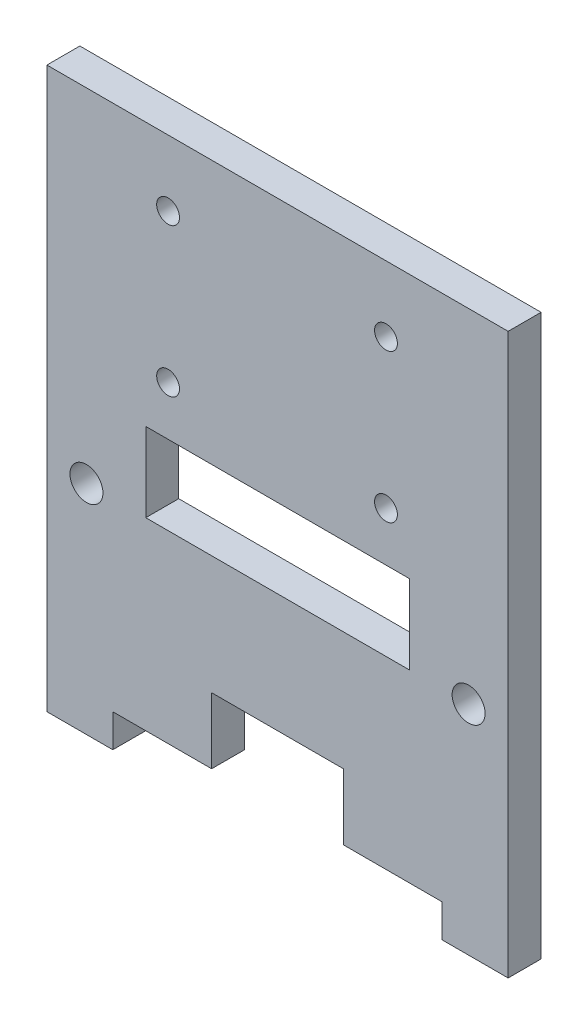
ISO-10303-21;
HEADER;
FILE_DESCRIPTION(('STEP AP214'),'2;1');
FILE_NAME('part.step','',(''),(''),'','','');
FILE_SCHEMA(('AUTOMOTIVE_DESIGN { 1 0 10303 214 1 1 1 1 }'));
ENDSEC;
DATA;
#1=APPLICATION_CONTEXT('core data for automotive mechanical design processes');
#2=APPLICATION_PROTOCOL_DEFINITION('international standard','automotive_design',2000,#1);
#3=PRODUCT_CONTEXT('',#1,'mechanical');
#4=PRODUCT('Part','Part','',(#3));
#5=PRODUCT_RELATED_PRODUCT_CATEGORY('part','',(#4));
#6=PRODUCT_DEFINITION_FORMATION('','',#4);
#7=PRODUCT_DEFINITION_CONTEXT('part definition',#1,'design');
#8=PRODUCT_DEFINITION('design','',#6,#7);
#9=PRODUCT_DEFINITION_SHAPE('','',#8);
#10=(LENGTH_UNIT() NAMED_UNIT(*) SI_UNIT(.MILLI.,.METRE.));
#11=(NAMED_UNIT(*) PLANE_ANGLE_UNIT() SI_UNIT($,.RADIAN.));
#12=(NAMED_UNIT(*) SI_UNIT($,.STERADIAN.) SOLID_ANGLE_UNIT());
#13=UNCERTAINTY_MEASURE_WITH_UNIT(LENGTH_MEASURE(1.E-05),#10,'distance_accuracy_value','');
#14=(GEOMETRIC_REPRESENTATION_CONTEXT(3) GLOBAL_UNCERTAINTY_ASSIGNED_CONTEXT((#13)) GLOBAL_UNIT_ASSIGNED_CONTEXT((#10,
#11,#12)) REPRESENTATION_CONTEXT('',''));
#15=CARTESIAN_POINT('',(0.,0.,0.));
#16=DIRECTION('',(0.,0.,1.));
#17=DIRECTION('',(1.,0.,0.));
#18=AXIS2_PLACEMENT_3D('',#15,#16,#17);
#19=CARTESIAN_POINT('',(6.35,3.175,0.));
#20=DIRECTION('',(0.,1.,0.));
#21=DIRECTION('',(0.,0.,1.));
#22=AXIS2_PLACEMENT_3D('',#19,#20,#21);
#23=PLANE('',#22);
#24=DIRECTION('',(-1.,0.,0.));
#25=VECTOR('',#24,1.);
#26=CARTESIAN_POINT('',(6.35,3.175,0.));
#27=LINE('',#26,#25);
#28=CARTESIAN_POINT('',(15.875,3.175,0.));
#29=VERTEX_POINT('',#28);
#30=CARTESIAN_POINT('',(6.35,3.175,0.));
#31=VERTEX_POINT('',#30);
#32=EDGE_CURVE('E275',#29,#31,#27,.T.);
#33=ORIENTED_EDGE('',*,*,#32,.F.);
#34=DIRECTION('',(0.,0.,1.));
#35=VECTOR('',#34,1.);
#36=CARTESIAN_POINT('',(15.875,3.175,0.));
#37=LINE('',#36,#35);
#38=CARTESIAN_POINT('',(15.875,3.175,3.175));
#39=VERTEX_POINT('',#38);
#40=EDGE_CURVE('E227',#29,#39,#37,.T.);
#41=ORIENTED_EDGE('',*,*,#40,.T.);
#42=DIRECTION('',(-1.,0.,0.));
#43=VECTOR('',#42,1.);
#44=CARTESIAN_POINT('',(6.35,3.175,3.175));
#45=LINE('',#44,#43);
#46=CARTESIAN_POINT('',(6.35,3.175,3.175));
#47=VERTEX_POINT('',#46);
#48=EDGE_CURVE('E289',#39,#47,#45,.T.);
#49=ORIENTED_EDGE('',*,*,#48,.T.);
#50=DIRECTION('',(0.,0.,1.));
#51=VECTOR('',#50,1.);
#52=CARTESIAN_POINT('',(6.35,3.175,0.));
#53=LINE('',#52,#51);
#54=EDGE_CURVE('E293',#31,#47,#53,.T.);
#55=ORIENTED_EDGE('',*,*,#54,.F.);
#56=EDGE_LOOP('',(#33,#41,#49,#55));
#57=FACE_BOUND('',#56,.T.);
#58=ADVANCED_FACE('F39',(#57),#23,.F.);
#59=CARTESIAN_POINT('',(0.,0.,3.175));
#60=DIRECTION('',(0.,1.,0.));
#61=DIRECTION('',(-1.,0.,0.));
#62=AXIS2_PLACEMENT_3D('',#59,#60,#61);
#63=PLANE('',#62);
#64=DIRECTION('',(1.,0.,0.));
#65=VECTOR('',#64,1.);
#66=CARTESIAN_POINT('',(0.,0.,0.));
#67=LINE('',#66,#65);
#68=CARTESIAN_POINT('',(0.,0.,0.));
#69=VERTEX_POINT('',#68);
#70=CARTESIAN_POINT('',(6.35,0.,0.));
#71=VERTEX_POINT('',#70);
#72=EDGE_CURVE('E328',#69,#71,#67,.T.);
#73=ORIENTED_EDGE('',*,*,#72,.T.);
#74=DIRECTION('',(0.,0.,1.));
#75=VECTOR('',#74,1.);
#76=CARTESIAN_POINT('',(6.35,0.,0.));
#77=LINE('',#76,#75);
#78=CARTESIAN_POINT('',(6.35,0.,3.175));
#79=VERTEX_POINT('',#78);
#80=EDGE_CURVE('E280',#71,#79,#77,.T.);
#81=ORIENTED_EDGE('',*,*,#80,.T.);
#82=DIRECTION('',(1.,0.,0.));
#83=VECTOR('',#82,1.);
#84=CARTESIAN_POINT('',(0.,0.,3.175));
#85=LINE('',#84,#83);
#86=CARTESIAN_POINT('',(0.,0.,3.175));
#87=VERTEX_POINT('',#86);
#88=EDGE_CURVE('E313',#87,#79,#85,.T.);
#89=ORIENTED_EDGE('',*,*,#88,.F.);
#90=DIRECTION('',(0.,0.,-1.));
#91=VECTOR('',#90,1.);
#92=CARTESIAN_POINT('',(0.,0.,3.175));
#93=LINE('',#92,#91);
#94=EDGE_CURVE('E11',#87,#69,#93,.T.);
#95=ORIENTED_EDGE('',*,*,#94,.T.);
#96=EDGE_LOOP('',(#73,#81,#89,#95));
#97=FACE_BOUND('',#96,.T.);
#98=ADVANCED_FACE('F430',(#97),#63,.F.);
#99=CARTESIAN_POINT('',(0.,0.,3.175));
#100=DIRECTION('',(1.,0.,0.));
#101=DIRECTION('',(0.,0.,-1.));
#102=AXIS2_PLACEMENT_3D('',#99,#100,#101);
#103=PLANE('',#102);
#104=DIRECTION('',(0.,-1.,0.));
#105=VECTOR('',#104,1.);
#106=CARTESIAN_POINT('',(0.,0.,0.));
#107=LINE('',#106,#105);
#108=CARTESIAN_POINT('',(0.,53.975,0.));
#109=VERTEX_POINT('',#108);
#110=EDGE_CURVE('E297',#109,#69,#107,.T.);
#111=ORIENTED_EDGE('',*,*,#110,.T.);
#112=ORIENTED_EDGE('',*,*,#94,.F.);
#113=DIRECTION('',(0.,-1.,0.));
#114=VECTOR('',#113,1.);
#115=CARTESIAN_POINT('',(0.,0.,3.175));
#116=LINE('',#115,#114);
#117=CARTESIAN_POINT('',(0.,53.975,3.175));
#118=VERTEX_POINT('',#117);
#119=EDGE_CURVE('E307',#118,#87,#116,.T.);
#120=ORIENTED_EDGE('',*,*,#119,.F.);
#121=DIRECTION('',(0.,0.,-1.));
#122=VECTOR('',#121,1.);
#123=CARTESIAN_POINT('',(0.,53.975,3.175));
#124=LINE('',#123,#122);
#125=EDGE_CURVE('E323',#118,#109,#124,.T.);
#126=ORIENTED_EDGE('',*,*,#125,.T.);
#127=EDGE_LOOP('',(#111,#112,#120,#126));
#128=FACE_BOUND('',#127,.T.);
#129=ADVANCED_FACE('F41',(#128),#103,.F.);
#130=CARTESIAN_POINT('',(38.1,0.,3.175));
#131=VERTEX_POINT('',#130);
#132=CARTESIAN_POINT('',(44.45,0.,3.175));
#133=VERTEX_POINT('',#132);
#134=EDGE_CURVE('E311',#131,#133,#85,.T.);
#135=ORIENTED_EDGE('',*,*,#134,.F.);
#136=DIRECTION('',(0.,0.,1.));
#137=VECTOR('',#136,1.);
#138=CARTESIAN_POINT('',(38.1,0.,0.));
#139=LINE('',#138,#137);
#140=CARTESIAN_POINT('',(38.1,0.,0.));
#141=VERTEX_POINT('',#140);
#142=EDGE_CURVE('E301',#141,#131,#139,.T.);
#143=ORIENTED_EDGE('',*,*,#142,.F.);
#144=CARTESIAN_POINT('',(44.45,0.,0.));
#145=VERTEX_POINT('',#144);
#146=EDGE_CURVE('E327',#141,#145,#67,.T.);
#147=ORIENTED_EDGE('',*,*,#146,.T.);
#148=DIRECTION('',(0.,0.,-1.));
#149=VECTOR('',#148,1.);
#150=CARTESIAN_POINT('',(44.45,0.,3.175));
#151=LINE('',#150,#149);
#152=EDGE_CURVE('E48',#133,#145,#151,.T.);
#153=ORIENTED_EDGE('',*,*,#152,.F.);
#154=EDGE_LOOP('',(#135,#143,#147,#153));
#155=FACE_BOUND('',#154,.T.);
#156=ADVANCED_FACE('F438',(#155),#63,.F.);
#157=CARTESIAN_POINT('',(44.45,0.,3.175));
#158=DIRECTION('',(-1.,0.,0.));
#159=DIRECTION('',(0.,0.,1.));
#160=AXIS2_PLACEMENT_3D('',#157,#158,#159);
#161=PLANE('',#160);
#162=DIRECTION('',(0.,1.,0.));
#163=VECTOR('',#162,1.);
#164=CARTESIAN_POINT('',(44.45,0.,0.));
#165=LINE('',#164,#163);
#166=CARTESIAN_POINT('',(44.45,53.975,0.));
#167=VERTEX_POINT('',#166);
#168=EDGE_CURVE('E332',#145,#167,#165,.T.);
#169=ORIENTED_EDGE('',*,*,#168,.T.);
#170=DIRECTION('',(0.,0.,-1.));
#171=VECTOR('',#170,1.);
#172=CARTESIAN_POINT('',(44.45,53.975,3.175));
#173=LINE('',#172,#171);
#174=CARTESIAN_POINT('',(44.45,53.975,3.175));
#175=VERTEX_POINT('',#174);
#176=EDGE_CURVE('E340',#175,#167,#173,.T.);
#177=ORIENTED_EDGE('',*,*,#176,.F.);
#178=DIRECTION('',(0.,1.,0.));
#179=VECTOR('',#178,1.);
#180=CARTESIAN_POINT('',(44.45,0.,3.175));
#181=LINE('',#180,#179);
#182=EDGE_CURVE('E317',#133,#175,#181,.T.);
#183=ORIENTED_EDGE('',*,*,#182,.F.);
#184=ORIENTED_EDGE('',*,*,#152,.T.);
#185=EDGE_LOOP('',(#169,#177,#183,#184));
#186=FACE_BOUND('',#185,.T.);
#187=ADVANCED_FACE('F349',(#186),#161,.F.);
#188=CARTESIAN_POINT('',(0.,53.975,3.175));
#189=DIRECTION('',(0.,-1.,0.));
#190=DIRECTION('',(0.,0.,-1.));
#191=AXIS2_PLACEMENT_3D('',#188,#189,#190);
#192=PLANE('',#191);
#193=DIRECTION('',(-1.,0.,0.));
#194=VECTOR('',#193,1.);
#195=CARTESIAN_POINT('',(0.,53.975,0.));
#196=LINE('',#195,#194);
#197=EDGE_CURVE('E312',#167,#109,#196,.T.);
#198=ORIENTED_EDGE('',*,*,#197,.T.);
#199=ORIENTED_EDGE('',*,*,#125,.F.);
#200=DIRECTION('',(-1.,0.,0.));
#201=VECTOR('',#200,1.);
#202=CARTESIAN_POINT('',(0.,53.975,3.175));
#203=LINE('',#202,#201);
#204=EDGE_CURVE('E320',#175,#118,#203,.T.);
#205=ORIENTED_EDGE('',*,*,#204,.F.);
#206=ORIENTED_EDGE('',*,*,#176,.T.);
#207=EDGE_LOOP('',(#198,#199,#205,#206));
#208=FACE_BOUND('',#207,.T.);
#209=ADVANCED_FACE('F360',(#208),#192,.F.);
#210=CARTESIAN_POINT('',(0.,0.,3.175));
#211=DIRECTION('',(0.,0.,-1.));
#212=DIRECTION('',(-1.,0.,0.));
#213=AXIS2_PLACEMENT_3D('',#210,#211,#212);
#214=PLANE('',#213);
#215=CARTESIAN_POINT('',(3.81,20.955,3.175));
#216=DIRECTION('',(0.,0.,1.));
#217=DIRECTION('',(1.,0.,0.));
#218=AXIS2_PLACEMENT_3D('',#215,#216,#217);
#219=CIRCLE('',#218,1.5875);
#220=CARTESIAN_POINT('',(5.3975,20.955,3.175));
#221=VERTEX_POINT('',#220);
#222=EDGE_CURVE('E208',#221,#221,#219,.T.);
#223=ORIENTED_EDGE('',*,*,#222,.F.);
#224=EDGE_LOOP('',(#223));
#225=FACE_BOUND('',#224,.T.);
#226=DIRECTION('',(1.,0.,0.));
#227=VECTOR('',#226,1.);
#228=CARTESIAN_POINT('',(9.52500000000001,20.955,3.175));
#229=LINE('',#228,#227);
#230=CARTESIAN_POINT('',(9.52500000000001,20.955,3.175));
#231=VERTEX_POINT('',#230);
#232=CARTESIAN_POINT('',(34.925,20.955,3.175));
#233=VERTEX_POINT('',#232);
#234=EDGE_CURVE('E190',#231,#233,#229,.T.);
#235=ORIENTED_EDGE('',*,*,#234,.F.);
#236=DIRECTION('',(0.,-1.,0.));
#237=VECTOR('',#236,1.);
#238=CARTESIAN_POINT('',(9.525,28.575,3.175));
#239=LINE('',#238,#237);
#240=CARTESIAN_POINT('',(9.525,28.575,3.175));
#241=VERTEX_POINT('',#240);
#242=EDGE_CURVE('E55',#241,#231,#239,.T.);
#243=ORIENTED_EDGE('',*,*,#242,.F.);
#244=DIRECTION('',(-1.,0.,0.));
#245=VECTOR('',#244,1.);
#246=CARTESIAN_POINT('',(9.525,28.575,3.175));
#247=LINE('',#246,#245);
#248=CARTESIAN_POINT('',(34.925,28.575,3.175));
#249=VERTEX_POINT('',#248);
#250=EDGE_CURVE('E174',#249,#241,#247,.T.);
#251=ORIENTED_EDGE('',*,*,#250,.F.);
#252=DIRECTION('',(0.,1.,0.));
#253=VECTOR('',#252,1.);
#254=CARTESIAN_POINT('',(34.925,28.575,3.175));
#255=LINE('',#254,#253);
#256=EDGE_CURVE('E178',#233,#249,#255,.T.);
#257=ORIENTED_EDGE('',*,*,#256,.F.);
#258=EDGE_LOOP('',(#235,#243,#251,#257));
#259=FACE_BOUND('',#258,.T.);
#260=CARTESIAN_POINT('',(32.6772125959636,33.325,3.175));
#261=DIRECTION('',(0.,0.,1.));
#262=DIRECTION('',(1.,0.,0.));
#263=AXIS2_PLACEMENT_3D('',#260,#261,#262);
#264=CIRCLE('',#263,1.1);
#265=CARTESIAN_POINT('',(33.7772125959636,33.325,3.175));
#266=VERTEX_POINT('',#265);
#267=EDGE_CURVE('E181',#266,#266,#264,.T.);
#268=ORIENTED_EDGE('',*,*,#267,.F.);
#269=EDGE_LOOP('',(#268));
#270=FACE_BOUND('',#269,.T.);
#271=CARTESIAN_POINT('',(32.6772125959636,47.625,3.175));
#272=DIRECTION('',(0.,0.,1.));
#273=DIRECTION('',(1.,0.,0.));
#274=AXIS2_PLACEMENT_3D('',#271,#272,#273);
#275=CIRCLE('',#274,1.1);
#276=CARTESIAN_POINT('',(33.7772125959636,47.625,3.175));
#277=VERTEX_POINT('',#276);
#278=EDGE_CURVE('E385',#277,#277,#275,.T.);
#279=ORIENTED_EDGE('',*,*,#278,.F.);
#280=EDGE_LOOP('',(#279));
#281=FACE_BOUND('',#280,.T.);
#282=CARTESIAN_POINT('',(11.6772125959636,33.325,3.175));
#283=DIRECTION('',(0.,0.,1.));
#284=DIRECTION('',(1.,0.,0.));
#285=AXIS2_PLACEMENT_3D('',#282,#283,#284);
#286=CIRCLE('',#285,1.1);
#287=CARTESIAN_POINT('',(12.7772125959636,33.325,3.175));
#288=VERTEX_POINT('',#287);
#289=EDGE_CURVE('E261',#288,#288,#286,.T.);
#290=ORIENTED_EDGE('',*,*,#289,.F.);
#291=EDGE_LOOP('',(#290));
#292=FACE_BOUND('',#291,.T.);
#293=CARTESIAN_POINT('',(11.6772125959636,47.625,3.175));
#294=DIRECTION('',(0.,0.,1.));
#295=DIRECTION('',(1.,0.,0.));
#296=AXIS2_PLACEMENT_3D('',#293,#294,#295);
#297=CIRCLE('',#296,1.1);
#298=CARTESIAN_POINT('',(12.7772125959636,47.625,3.175));
#299=VERTEX_POINT('',#298);
#300=EDGE_CURVE('E253',#299,#299,#297,.T.);
#301=ORIENTED_EDGE('',*,*,#300,.F.);
#302=EDGE_LOOP('',(#301));
#303=FACE_BOUND('',#302,.T.);
#304=CARTESIAN_POINT('',(40.64,20.955,3.175));
#305=DIRECTION('',(0.,0.,1.));
#306=DIRECTION('',(-1.,0.,0.));
#307=AXIS2_PLACEMENT_3D('',#304,#305,#306);
#308=CIRCLE('',#307,1.58750000000001);
#309=CARTESIAN_POINT('',(39.0525,20.955,3.175));
#310=VERTEX_POINT('',#309);
#311=EDGE_CURVE('E209',#310,#310,#308,.T.);
#312=ORIENTED_EDGE('',*,*,#311,.F.);
#313=EDGE_LOOP('',(#312));
#314=FACE_BOUND('',#313,.T.);
#315=ORIENTED_EDGE('',*,*,#48,.F.);
#316=DIRECTION('',(0.,-1.,0.));
#317=VECTOR('',#316,1.);
#318=CARTESIAN_POINT('',(15.875,3.175,3.175));
#319=LINE('',#318,#317);
#320=CARTESIAN_POINT('',(15.875,9.525,3.175));
#321=VERTEX_POINT('',#320);
#322=EDGE_CURVE('E228',#321,#39,#319,.T.);
#323=ORIENTED_EDGE('',*,*,#322,.F.);
#324=DIRECTION('',(-1.,0.,0.));
#325=VECTOR('',#324,1.);
#326=CARTESIAN_POINT('',(15.875,9.525,3.175));
#327=LINE('',#326,#325);
#328=CARTESIAN_POINT('',(28.575,9.525,3.175));
#329=VERTEX_POINT('',#328);
#330=EDGE_CURVE('E219',#329,#321,#327,.T.);
#331=ORIENTED_EDGE('',*,*,#330,.F.);
#332=DIRECTION('',(0.,1.,0.));
#333=VECTOR('',#332,1.);
#334=CARTESIAN_POINT('',(28.575,3.175,3.175));
#335=LINE('',#334,#333);
#336=CARTESIAN_POINT('',(28.575,3.175,3.175));
#337=VERTEX_POINT('',#336);
#338=EDGE_CURVE('E231',#337,#329,#335,.T.);
#339=ORIENTED_EDGE('',*,*,#338,.F.);
#340=CARTESIAN_POINT('',(38.1,3.175,3.175));
#341=VERTEX_POINT('',#340);
#342=EDGE_CURVE('E271',#341,#337,#45,.T.);
#343=ORIENTED_EDGE('',*,*,#342,.F.);
#344=DIRECTION('',(0.,1.,0.));
#345=VECTOR('',#344,1.);
#346=CARTESIAN_POINT('',(38.1,0.,3.175));
#347=LINE('',#346,#345);
#348=EDGE_CURVE('E284',#131,#341,#347,.T.);
#349=ORIENTED_EDGE('',*,*,#348,.F.);
#350=ORIENTED_EDGE('',*,*,#134,.T.);
#351=ORIENTED_EDGE('',*,*,#182,.T.);
#352=ORIENTED_EDGE('',*,*,#204,.T.);
#353=ORIENTED_EDGE('',*,*,#119,.T.);
#354=ORIENTED_EDGE('',*,*,#88,.T.);
#355=DIRECTION('',(0.,-1.,0.));
#356=VECTOR('',#355,1.);
#357=CARTESIAN_POINT('',(6.35,0.,3.175));
#358=LINE('',#357,#356);
#359=EDGE_CURVE('E281',#47,#79,#358,.T.);
#360=ORIENTED_EDGE('',*,*,#359,.F.);
#361=EDGE_LOOP('',(#315,#323,#331,#339,#343,#349,#350,#351,#352,#353,#354,#360));
#362=FACE_BOUND('',#361,.T.);
#363=ADVANCED_FACE('F367',(#225,#259,#270,#281,#292,#303,#314,#362),#214,.F.);
#364=CARTESIAN_POINT('',(0.,0.,0.));
#365=DIRECTION('',(0.,0.,-1.));
#366=DIRECTION('',(-1.,0.,0.));
#367=AXIS2_PLACEMENT_3D('',#364,#365,#366);
#368=PLANE('',#367);
#369=CARTESIAN_POINT('',(3.81,20.955,0.));
#370=DIRECTION('',(0.,0.,1.));
#371=DIRECTION('',(1.,0.,0.));
#372=AXIS2_PLACEMENT_3D('',#369,#370,#371);
#373=CIRCLE('',#372,1.5875);
#374=CARTESIAN_POINT('',(5.3975,20.955,0.));
#375=VERTEX_POINT('',#374);
#376=EDGE_CURVE('E285',#375,#375,#373,.T.);
#377=ORIENTED_EDGE('',*,*,#376,.T.);
#378=EDGE_LOOP('',(#377));
#379=FACE_BOUND('',#378,.T.);
#380=DIRECTION('',(0.,-1.,0.));
#381=VECTOR('',#380,1.);
#382=CARTESIAN_POINT('',(9.525,28.575,0.));
#383=LINE('',#382,#381);
#384=CARTESIAN_POINT('',(9.525,28.575,0.));
#385=VERTEX_POINT('',#384);
#386=CARTESIAN_POINT('',(9.52500000000001,20.955,0.));
#387=VERTEX_POINT('',#386);
#388=EDGE_CURVE('E155',#385,#387,#383,.T.);
#389=ORIENTED_EDGE('',*,*,#388,.T.);
#390=DIRECTION('',(1.,0.,0.));
#391=VECTOR('',#390,1.);
#392=CARTESIAN_POINT('',(9.52500000000001,20.955,0.));
#393=LINE('',#392,#391);
#394=CARTESIAN_POINT('',(34.925,20.955,0.));
#395=VERTEX_POINT('',#394);
#396=EDGE_CURVE('E165',#387,#395,#393,.T.);
#397=ORIENTED_EDGE('',*,*,#396,.T.);
#398=DIRECTION('',(0.,1.,0.));
#399=VECTOR('',#398,1.);
#400=CARTESIAN_POINT('',(34.925,28.575,0.));
#401=LINE('',#400,#399);
#402=CARTESIAN_POINT('',(34.925,28.575,0.));
#403=VERTEX_POINT('',#402);
#404=EDGE_CURVE('E63',#395,#403,#401,.T.);
#405=ORIENTED_EDGE('',*,*,#404,.T.);
#406=DIRECTION('',(-1.,0.,0.));
#407=VECTOR('',#406,1.);
#408=CARTESIAN_POINT('',(9.525,28.575,0.));
#409=LINE('',#408,#407);
#410=EDGE_CURVE('E162',#403,#385,#409,.T.);
#411=ORIENTED_EDGE('',*,*,#410,.T.);
#412=EDGE_LOOP('',(#389,#397,#405,#411));
#413=FACE_BOUND('',#412,.T.);
#414=CARTESIAN_POINT('',(32.6772125959636,33.325,0.));
#415=DIRECTION('',(0.,0.,1.));
#416=DIRECTION('',(1.,0.,0.));
#417=AXIS2_PLACEMENT_3D('',#414,#415,#416);
#418=CIRCLE('',#417,1.1);
#419=CARTESIAN_POINT('',(33.7772125959636,33.325,0.));
#420=VERTEX_POINT('',#419);
#421=EDGE_CURVE('E389',#420,#420,#418,.T.);
#422=ORIENTED_EDGE('',*,*,#421,.T.);
#423=EDGE_LOOP('',(#422));
#424=FACE_BOUND('',#423,.T.);
#425=CARTESIAN_POINT('',(32.6772125959636,47.625,0.));
#426=DIRECTION('',(0.,0.,1.));
#427=DIRECTION('',(1.,0.,0.));
#428=AXIS2_PLACEMENT_3D('',#425,#426,#427);
#429=CIRCLE('',#428,1.1);
#430=CARTESIAN_POINT('',(33.7772125959636,47.625,0.));
#431=VERTEX_POINT('',#430);
#432=EDGE_CURVE('E265',#431,#431,#429,.T.);
#433=ORIENTED_EDGE('',*,*,#432,.T.);
#434=EDGE_LOOP('',(#433));
#435=FACE_BOUND('',#434,.T.);
#436=CARTESIAN_POINT('',(11.6772125959636,33.325,0.));
#437=DIRECTION('',(0.,0.,1.));
#438=DIRECTION('',(1.,0.,0.));
#439=AXIS2_PLACEMENT_3D('',#436,#437,#438);
#440=CIRCLE('',#439,1.1);
#441=CARTESIAN_POINT('',(12.7772125959636,33.325,0.));
#442=VERTEX_POINT('',#441);
#443=EDGE_CURVE('E257',#442,#442,#440,.T.);
#444=ORIENTED_EDGE('',*,*,#443,.T.);
#445=EDGE_LOOP('',(#444));
#446=FACE_BOUND('',#445,.T.);
#447=CARTESIAN_POINT('',(11.6772125959636,47.625,0.));
#448=DIRECTION('',(0.,0.,1.));
#449=DIRECTION('',(1.,0.,0.));
#450=AXIS2_PLACEMENT_3D('',#447,#448,#449);
#451=CIRCLE('',#450,1.1);
#452=CARTESIAN_POINT('',(12.7772125959636,47.625,0.));
#453=VERTEX_POINT('',#452);
#454=EDGE_CURVE('E232',#453,#453,#451,.T.);
#455=ORIENTED_EDGE('',*,*,#454,.T.);
#456=EDGE_LOOP('',(#455));
#457=FACE_BOUND('',#456,.T.);
#458=DIRECTION('',(0.,-1.,0.));
#459=VECTOR('',#458,1.);
#460=CARTESIAN_POINT('',(15.875,3.175,0.));
#461=LINE('',#460,#459);
#462=CARTESIAN_POINT('',(15.875,9.525,0.));
#463=VERTEX_POINT('',#462);
#464=EDGE_CURVE('E214',#463,#29,#461,.T.);
#465=ORIENTED_EDGE('',*,*,#464,.T.);
#466=ORIENTED_EDGE('',*,*,#32,.T.);
#467=DIRECTION('',(0.,-1.,0.));
#468=VECTOR('',#467,1.);
#469=CARTESIAN_POINT('',(6.35,0.,0.));
#470=LINE('',#469,#468);
#471=EDGE_CURVE('E266',#31,#71,#470,.T.);
#472=ORIENTED_EDGE('',*,*,#471,.T.);
#473=ORIENTED_EDGE('',*,*,#72,.F.);
#474=ORIENTED_EDGE('',*,*,#110,.F.);
#475=ORIENTED_EDGE('',*,*,#197,.F.);
#476=ORIENTED_EDGE('',*,*,#168,.F.);
#477=ORIENTED_EDGE('',*,*,#146,.F.);
#478=DIRECTION('',(0.,1.,0.));
#479=VECTOR('',#478,1.);
#480=CARTESIAN_POINT('',(38.1,0.,0.));
#481=LINE('',#480,#479);
#482=CARTESIAN_POINT('',(38.1,3.175,0.));
#483=VERTEX_POINT('',#482);
#484=EDGE_CURVE('E270',#141,#483,#481,.T.);
#485=ORIENTED_EDGE('',*,*,#484,.T.);
#486=CARTESIAN_POINT('',(28.575,3.175,0.));
#487=VERTEX_POINT('',#486);
#488=EDGE_CURVE('E276',#483,#487,#27,.T.);
#489=ORIENTED_EDGE('',*,*,#488,.T.);
#490=DIRECTION('',(0.,1.,0.));
#491=VECTOR('',#490,1.);
#492=CARTESIAN_POINT('',(28.575,3.175,0.));
#493=LINE('',#492,#491);
#494=CARTESIAN_POINT('',(28.575,9.525,0.));
#495=VERTEX_POINT('',#494);
#496=EDGE_CURVE('E218',#487,#495,#493,.T.);
#497=ORIENTED_EDGE('',*,*,#496,.T.);
#498=DIRECTION('',(-1.,0.,0.));
#499=VECTOR('',#498,1.);
#500=CARTESIAN_POINT('',(15.875,9.525,0.));
#501=LINE('',#500,#499);
#502=EDGE_CURVE('E223',#495,#463,#501,.T.);
#503=ORIENTED_EDGE('',*,*,#502,.T.);
#504=EDGE_LOOP('',(#465,#466,#472,#473,#474,#475,#476,#477,#485,#489,#497,#503));
#505=FACE_BOUND('',#504,.T.);
#506=CARTESIAN_POINT('',(40.64,20.955,0.));
#507=DIRECTION('',(0.,0.,1.));
#508=DIRECTION('',(-1.,0.,0.));
#509=AXIS2_PLACEMENT_3D('',#506,#507,#508);
#510=CIRCLE('',#509,1.58750000000001);
#511=CARTESIAN_POINT('',(39.0525,20.955,0.));
#512=VERTEX_POINT('',#511);
#513=EDGE_CURVE('E204',#512,#512,#510,.T.);
#514=ORIENTED_EDGE('',*,*,#513,.T.);
#515=EDGE_LOOP('',(#514));
#516=FACE_BOUND('',#515,.T.);
#517=ADVANCED_FACE('F170',(#379,#413,#424,#435,#446,#457,#505,#516),#368,.T.);
#518=CARTESIAN_POINT('',(6.35,0.,0.));
#519=DIRECTION('',(-1.,0.,0.));
#520=DIRECTION('',(0.,0.,1.));
#521=AXIS2_PLACEMENT_3D('',#518,#519,#520);
#522=PLANE('',#521);
#523=ORIENTED_EDGE('',*,*,#359,.T.);
#524=ORIENTED_EDGE('',*,*,#80,.F.);
#525=ORIENTED_EDGE('',*,*,#471,.F.);
#526=ORIENTED_EDGE('',*,*,#54,.T.);
#527=EDGE_LOOP('',(#523,#524,#525,#526));
#528=FACE_BOUND('',#527,.T.);
#529=ADVANCED_FACE('F444',(#528),#522,.F.);
#530=ORIENTED_EDGE('',*,*,#342,.T.);
#531=DIRECTION('',(0.,0.,1.));
#532=VECTOR('',#531,1.);
#533=CARTESIAN_POINT('',(28.575,3.175,0.));
#534=LINE('',#533,#532);
#535=EDGE_CURVE('E244',#487,#337,#534,.T.);
#536=ORIENTED_EDGE('',*,*,#535,.F.);
#537=ORIENTED_EDGE('',*,*,#488,.F.);
#538=DIRECTION('',(0.,0.,1.));
#539=VECTOR('',#538,1.);
#540=CARTESIAN_POINT('',(38.1,3.175,0.));
#541=LINE('',#540,#539);
#542=EDGE_CURVE('E298',#483,#341,#541,.T.);
#543=ORIENTED_EDGE('',*,*,#542,.T.);
#544=EDGE_LOOP('',(#530,#536,#537,#543));
#545=FACE_BOUND('',#544,.T.);
#546=ADVANCED_FACE('F433',(#545),#23,.F.);
#547=CARTESIAN_POINT('',(38.1,0.,0.));
#548=DIRECTION('',(1.,0.,0.));
#549=DIRECTION('',(0.,0.,-1.));
#550=AXIS2_PLACEMENT_3D('',#547,#548,#549);
#551=PLANE('',#550);
#552=ORIENTED_EDGE('',*,*,#348,.T.);
#553=ORIENTED_EDGE('',*,*,#542,.F.);
#554=ORIENTED_EDGE('',*,*,#484,.F.);
#555=ORIENTED_EDGE('',*,*,#142,.T.);
#556=EDGE_LOOP('',(#552,#553,#554,#555));
#557=FACE_BOUND('',#556,.T.);
#558=ADVANCED_FACE('F443',(#557),#551,.F.);
#559=CARTESIAN_POINT('',(15.875,3.175,0.));
#560=DIRECTION('',(-1.,0.,0.));
#561=DIRECTION('',(0.,0.,1.));
#562=AXIS2_PLACEMENT_3D('',#559,#560,#561);
#563=PLANE('',#562);
#564=ORIENTED_EDGE('',*,*,#322,.T.);
#565=ORIENTED_EDGE('',*,*,#40,.F.);
#566=ORIENTED_EDGE('',*,*,#464,.F.);
#567=DIRECTION('',(0.,0.,1.));
#568=VECTOR('',#567,1.);
#569=CARTESIAN_POINT('',(15.875,9.525,0.));
#570=LINE('',#569,#568);
#571=EDGE_CURVE('E213',#463,#321,#570,.T.);
#572=ORIENTED_EDGE('',*,*,#571,.T.);
#573=EDGE_LOOP('',(#564,#565,#566,#572));
#574=FACE_BOUND('',#573,.T.);
#575=ADVANCED_FACE('F450',(#574),#563,.F.);
#576=CARTESIAN_POINT('',(15.875,9.525,0.));
#577=DIRECTION('',(0.,1.,0.));
#578=DIRECTION('',(0.,0.,1.));
#579=AXIS2_PLACEMENT_3D('',#576,#577,#578);
#580=PLANE('',#579);
#581=ORIENTED_EDGE('',*,*,#330,.T.);
#582=ORIENTED_EDGE('',*,*,#571,.F.);
#583=ORIENTED_EDGE('',*,*,#502,.F.);
#584=DIRECTION('',(0.,0.,1.));
#585=VECTOR('',#584,1.);
#586=CARTESIAN_POINT('',(28.575,9.525,0.));
#587=LINE('',#586,#585);
#588=EDGE_CURVE('E241',#495,#329,#587,.T.);
#589=ORIENTED_EDGE('',*,*,#588,.T.);
#590=EDGE_LOOP('',(#581,#582,#583,#589));
#591=FACE_BOUND('',#590,.T.);
#592=ADVANCED_FACE('F423',(#591),#580,.F.);
#593=CARTESIAN_POINT('',(28.575,3.175,0.));
#594=DIRECTION('',(1.,0.,0.));
#595=DIRECTION('',(0.,0.,-1.));
#596=AXIS2_PLACEMENT_3D('',#593,#594,#595);
#597=PLANE('',#596);
#598=ORIENTED_EDGE('',*,*,#338,.T.);
#599=ORIENTED_EDGE('',*,*,#588,.F.);
#600=ORIENTED_EDGE('',*,*,#496,.F.);
#601=ORIENTED_EDGE('',*,*,#535,.T.);
#602=EDGE_LOOP('',(#598,#599,#600,#601));
#603=FACE_BOUND('',#602,.T.);
#604=ADVANCED_FACE('F413',(#603),#597,.F.);
#605=CARTESIAN_POINT('',(40.64,20.955,0.));
#606=DIRECTION('',(0.,0.,1.));
#607=DIRECTION('',(1.,0.,0.));
#608=AXIS2_PLACEMENT_3D('',#605,#606,#607);
#609=CYLINDRICAL_SURFACE('',#608,1.58750000000001);
#610=ORIENTED_EDGE('',*,*,#513,.F.);
#611=EDGE_LOOP('',(#610));
#612=FACE_BOUND('',#611,.T.);
#613=ORIENTED_EDGE('',*,*,#311,.T.);
#614=EDGE_LOOP('',(#613));
#615=FACE_BOUND('',#614,.T.);
#616=ADVANCED_FACE('F410',(#612,#615),#609,.F.);
#617=CARTESIAN_POINT('',(11.6772125959636,47.625,0.));
#618=DIRECTION('',(0.,0.,1.));
#619=DIRECTION('',(1.,0.,0.));
#620=AXIS2_PLACEMENT_3D('',#617,#618,#619);
#621=CYLINDRICAL_SURFACE('',#620,1.1);
#622=ORIENTED_EDGE('',*,*,#454,.F.);
#623=EDGE_LOOP('',(#622));
#624=FACE_BOUND('',#623,.T.);
#625=ORIENTED_EDGE('',*,*,#300,.T.);
#626=EDGE_LOOP('',(#625));
#627=FACE_BOUND('',#626,.T.);
#628=ADVANCED_FACE('F412',(#624,#627),#621,.F.);
#629=CARTESIAN_POINT('',(11.6772125959636,33.325,0.));
#630=DIRECTION('',(0.,0.,1.));
#631=DIRECTION('',(1.,0.,0.));
#632=AXIS2_PLACEMENT_3D('',#629,#630,#631);
#633=CYLINDRICAL_SURFACE('',#632,1.1);
#634=ORIENTED_EDGE('',*,*,#443,.F.);
#635=EDGE_LOOP('',(#634));
#636=FACE_BOUND('',#635,.T.);
#637=ORIENTED_EDGE('',*,*,#289,.T.);
#638=EDGE_LOOP('',(#637));
#639=FACE_BOUND('',#638,.T.);
#640=ADVANCED_FACE('F420',(#636,#639),#633,.F.);
#641=CARTESIAN_POINT('',(32.6772125959636,47.625,0.));
#642=DIRECTION('',(0.,0.,1.));
#643=DIRECTION('',(1.,0.,0.));
#644=AXIS2_PLACEMENT_3D('',#641,#642,#643);
#645=CYLINDRICAL_SURFACE('',#644,1.1);
#646=ORIENTED_EDGE('',*,*,#432,.F.);
#647=EDGE_LOOP('',(#646));
#648=FACE_BOUND('',#647,.T.);
#649=ORIENTED_EDGE('',*,*,#278,.T.);
#650=EDGE_LOOP('',(#649));
#651=FACE_BOUND('',#650,.T.);
#652=ADVANCED_FACE('F530',(#648,#651),#645,.F.);
#653=CARTESIAN_POINT('',(32.6772125959636,33.325,0.));
#654=DIRECTION('',(0.,0.,1.));
#655=DIRECTION('',(1.,0.,0.));
#656=AXIS2_PLACEMENT_3D('',#653,#654,#655);
#657=CYLINDRICAL_SURFACE('',#656,1.1);
#658=ORIENTED_EDGE('',*,*,#421,.F.);
#659=EDGE_LOOP('',(#658));
#660=FACE_BOUND('',#659,.T.);
#661=ORIENTED_EDGE('',*,*,#267,.T.);
#662=EDGE_LOOP('',(#661));
#663=FACE_BOUND('',#662,.T.);
#664=ADVANCED_FACE('F396',(#660,#663),#657,.F.);
#665=CARTESIAN_POINT('',(9.525,28.575,0.));
#666=DIRECTION('',(-1.,0.,0.));
#667=DIRECTION('',(0.,-1.,0.));
#668=AXIS2_PLACEMENT_3D('',#665,#666,#667);
#669=PLANE('',#668);
#670=ORIENTED_EDGE('',*,*,#242,.T.);
#671=DIRECTION('',(0.,0.,1.));
#672=VECTOR('',#671,1.);
#673=CARTESIAN_POINT('',(9.52500000000001,20.955,0.));
#674=LINE('',#673,#672);
#675=EDGE_CURVE('E151',#387,#231,#674,.T.);
#676=ORIENTED_EDGE('',*,*,#675,.F.);
#677=ORIENTED_EDGE('',*,*,#388,.F.);
#678=DIRECTION('',(0.,0.,1.));
#679=VECTOR('',#678,1.);
#680=CARTESIAN_POINT('',(9.525,28.575,0.));
#681=LINE('',#680,#679);
#682=EDGE_CURVE('E196',#385,#241,#681,.T.);
#683=ORIENTED_EDGE('',*,*,#682,.T.);
#684=EDGE_LOOP('',(#670,#676,#677,#683));
#685=FACE_BOUND('',#684,.T.);
#686=ADVANCED_FACE('F153',(#685),#669,.F.);
#687=CARTESIAN_POINT('',(9.525,28.575,0.));
#688=DIRECTION('',(0.,1.,0.));
#689=DIRECTION('',(-1.,0.,0.));
#690=AXIS2_PLACEMENT_3D('',#687,#688,#689);
#691=PLANE('',#690);
#692=ORIENTED_EDGE('',*,*,#250,.T.);
#693=ORIENTED_EDGE('',*,*,#682,.F.);
#694=ORIENTED_EDGE('',*,*,#410,.F.);
#695=DIRECTION('',(0.,0.,1.));
#696=VECTOR('',#695,1.);
#697=CARTESIAN_POINT('',(34.925,28.575,0.));
#698=LINE('',#697,#696);
#699=EDGE_CURVE('E199',#403,#249,#698,.T.);
#700=ORIENTED_EDGE('',*,*,#699,.T.);
#701=EDGE_LOOP('',(#692,#693,#694,#700));
#702=FACE_BOUND('',#701,.T.);
#703=ADVANCED_FACE('F485',(#702),#691,.F.);
#704=CARTESIAN_POINT('',(34.925,28.575,0.));
#705=DIRECTION('',(1.,0.,0.));
#706=DIRECTION('',(0.,0.,-1.));
#707=AXIS2_PLACEMENT_3D('',#704,#705,#706);
#708=PLANE('',#707);
#709=ORIENTED_EDGE('',*,*,#256,.T.);
#710=ORIENTED_EDGE('',*,*,#699,.F.);
#711=ORIENTED_EDGE('',*,*,#404,.F.);
#712=DIRECTION('',(0.,0.,1.));
#713=VECTOR('',#712,1.);
#714=CARTESIAN_POINT('',(34.925,20.955,0.));
#715=LINE('',#714,#713);
#716=EDGE_CURVE('E161',#395,#233,#715,.T.);
#717=ORIENTED_EDGE('',*,*,#716,.T.);
#718=EDGE_LOOP('',(#709,#710,#711,#717));
#719=FACE_BOUND('',#718,.T.);
#720=ADVANCED_FACE('F483',(#719),#708,.F.);
#721=CARTESIAN_POINT('',(9.52500000000001,20.955,0.));
#722=DIRECTION('',(0.,-1.,0.));
#723=DIRECTION('',(0.,0.,-1.));
#724=AXIS2_PLACEMENT_3D('',#721,#722,#723);
#725=PLANE('',#724);
#726=ORIENTED_EDGE('',*,*,#234,.T.);
#727=ORIENTED_EDGE('',*,*,#716,.F.);
#728=ORIENTED_EDGE('',*,*,#396,.F.);
#729=ORIENTED_EDGE('',*,*,#675,.T.);
#730=EDGE_LOOP('',(#726,#727,#728,#729));
#731=FACE_BOUND('',#730,.T.);
#732=ADVANCED_FACE('F166',(#731),#725,.F.);
#733=CARTESIAN_POINT('',(3.81,20.955,0.));
#734=DIRECTION('',(0.,0.,1.));
#735=DIRECTION('',(1.,0.,0.));
#736=AXIS2_PLACEMENT_3D('',#733,#734,#735);
#737=CYLINDRICAL_SURFACE('',#736,1.5875);
#738=ORIENTED_EDGE('',*,*,#376,.F.);
#739=EDGE_LOOP('',(#738));
#740=FACE_BOUND('',#739,.T.);
#741=ORIENTED_EDGE('',*,*,#222,.T.);
#742=EDGE_LOOP('',(#741));
#743=FACE_BOUND('',#742,.T.);
#744=ADVANCED_FACE('F475',(#740,#743),#737,.F.);
#745=CLOSED_SHELL('',(#58,#98,#129,#156,#187,#209,#363,#517,#529,#546,#558,#575,#592,#604,#616,
#628,#640,#652,#664,#686,#703,#720,#732,#744));
#746=MANIFOLD_SOLID_BREP('B2',#745);
#747=ADVANCED_BREP_SHAPE_REPRESENTATION('',(#18,#746),#14);
#748=SHAPE_DEFINITION_REPRESENTATION(#9,#747);
ENDSEC;
END-ISO-10303-21;
